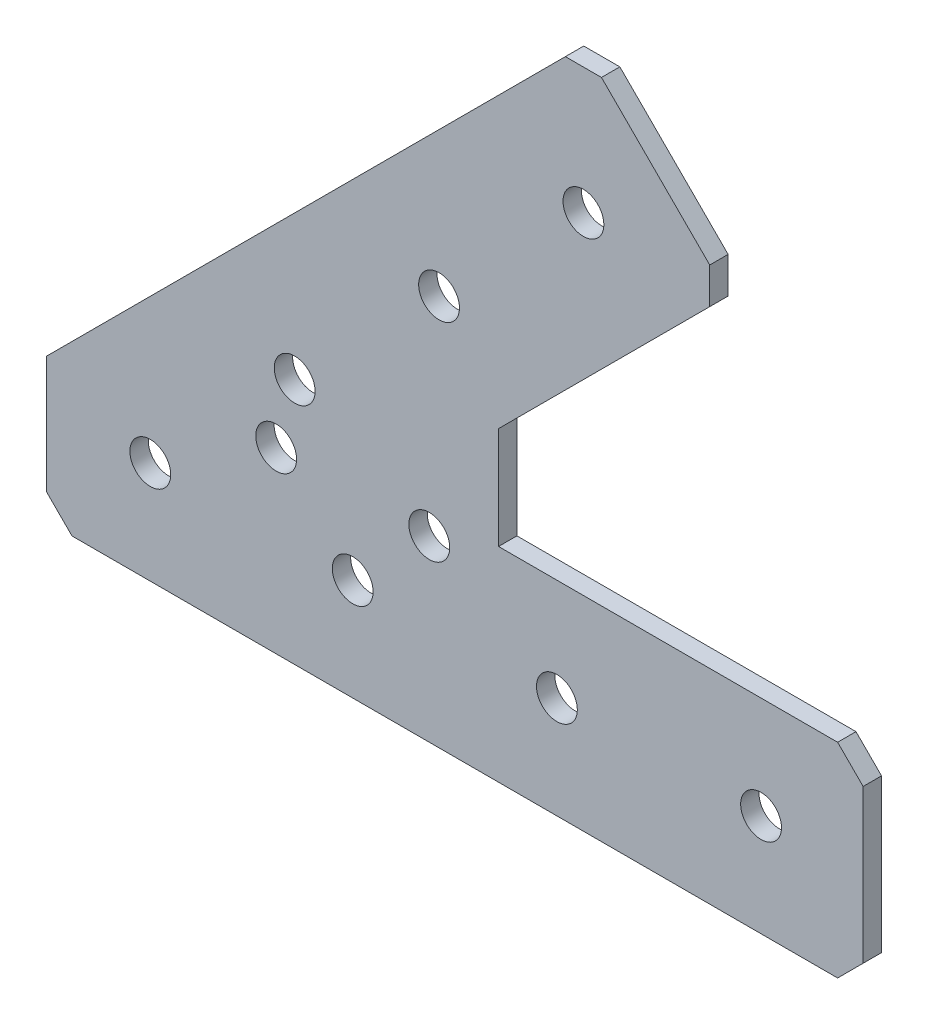
ISO-10303-21;
HEADER;
FILE_DESCRIPTION(('STEP AP214'),'2;1');
FILE_NAME('part.step','',(''),(''),'','','');
FILE_SCHEMA(('AUTOMOTIVE_DESIGN { 1 0 10303 214 1 1 1 1 }'));
ENDSEC;
DATA;
#1=APPLICATION_CONTEXT('core data for automotive mechanical design processes');
#2=APPLICATION_PROTOCOL_DEFINITION('international standard','automotive_design',2000,#1);
#3=PRODUCT_CONTEXT('',#1,'mechanical');
#4=PRODUCT('Part','Part','',(#3));
#5=PRODUCT_RELATED_PRODUCT_CATEGORY('part','',(#4));
#6=PRODUCT_DEFINITION_FORMATION('','',#4);
#7=PRODUCT_DEFINITION_CONTEXT('part definition',#1,'design');
#8=PRODUCT_DEFINITION('design','',#6,#7);
#9=PRODUCT_DEFINITION_SHAPE('','',#8);
#10=(LENGTH_UNIT() NAMED_UNIT(*) SI_UNIT(.MILLI.,.METRE.));
#11=(NAMED_UNIT(*) PLANE_ANGLE_UNIT() SI_UNIT($,.RADIAN.));
#12=(NAMED_UNIT(*) SI_UNIT($,.STERADIAN.) SOLID_ANGLE_UNIT());
#13=UNCERTAINTY_MEASURE_WITH_UNIT(LENGTH_MEASURE(1.E-05),#10,'distance_accuracy_value','');
#14=(GEOMETRIC_REPRESENTATION_CONTEXT(3) GLOBAL_UNCERTAINTY_ASSIGNED_CONTEXT((#13)) GLOBAL_UNIT_ASSIGNED_CONTEXT((#10,
#11,#12)) REPRESENTATION_CONTEXT('',''));
#15=CARTESIAN_POINT('',(0.,0.,0.));
#16=DIRECTION('',(0.,0.,1.));
#17=DIRECTION('',(1.,0.,0.));
#18=AXIS2_PLACEMENT_3D('',#15,#16,#17);
#19=CARTESIAN_POINT('',(0.,0.,-2.286));
#20=DIRECTION('',(0.,0.,1.));
#21=DIRECTION('',(1.,0.,0.));
#22=AXIS2_PLACEMENT_3D('',#19,#20,#21);
#23=PLANE('',#22);
#24=DIRECTION('',(0.,1.,0.));
#25=VECTOR('',#24,1.);
#26=CARTESIAN_POINT('',(27.9053360497169,51.6743115654397,-2.286));
#27=LINE('',#26,#25);
#28=CARTESIAN_POINT('',(27.9053360497169,51.6743115654397,-2.286));
#29=VERTEX_POINT('',#28);
#30=CARTESIAN_POINT('',(27.9053360497169,56.1644396259744,-2.286));
#31=VERTEX_POINT('',#30);
#32=EDGE_CURVE('E531',#29,#31,#27,.T.);
#33=ORIENTED_EDGE('',*,*,#32,.F.);
#34=DIRECTION('',(0.707106781186551,0.707106781186544,0.));
#35=VECTOR('',#34,1.);
#36=CARTESIAN_POINT('',(1.63102448427699,25.4000000000001,-2.286));
#37=LINE('',#36,#35);
#38=CARTESIAN_POINT('',(1.63102448427699,25.4000000000001,-2.286));
#39=VERTEX_POINT('',#38);
#40=EDGE_CURVE('E528',#39,#29,#37,.T.);
#41=ORIENTED_EDGE('',*,*,#40,.F.);
#42=DIRECTION('',(0.,1.,0.));
#43=VECTOR('',#42,1.);
#44=CARTESIAN_POINT('',(1.63102448427696,12.7,-2.286));
#45=LINE('',#44,#43);
#46=CARTESIAN_POINT('',(1.63102448427696,12.7,-2.286));
#47=VERTEX_POINT('',#46);
#48=EDGE_CURVE('E523',#47,#39,#45,.T.);
#49=ORIENTED_EDGE('',*,*,#48,.F.);
#50=DIRECTION('',(1.,0.,0.));
#51=VECTOR('',#50,1.);
#52=CARTESIAN_POINT('',(43.815,12.7,-2.286));
#53=LINE('',#52,#51);
#54=CARTESIAN_POINT('',(43.815,12.7,-2.286));
#55=VERTEX_POINT('',#54);
#56=EDGE_CURVE('E518',#55,#47,#53,.F.);
#57=ORIENTED_EDGE('',*,*,#56,.F.);
#58=DIRECTION('',(-0.707106781186549,0.707106781186546,0.));
#59=VECTOR('',#58,1.);
#60=CARTESIAN_POINT('',(46.99,9.52499999999999,-2.286));
#61=LINE('',#60,#59);
#62=CARTESIAN_POINT('',(46.99,9.52499999999999,-2.286));
#63=VERTEX_POINT('',#62);
#64=EDGE_CURVE('E513',#63,#55,#61,.T.);
#65=ORIENTED_EDGE('',*,*,#64,.F.);
#66=DIRECTION('',(0.,1.,0.));
#67=VECTOR('',#66,1.);
#68=CARTESIAN_POINT('',(46.99,-9.52499999999998,-2.286));
#69=LINE('',#68,#67);
#70=CARTESIAN_POINT('',(46.99,-9.52499999999998,-2.286));
#71=VERTEX_POINT('',#70);
#72=EDGE_CURVE('E508',#71,#63,#69,.T.);
#73=ORIENTED_EDGE('',*,*,#72,.F.);
#74=DIRECTION('',(0.707106781186545,0.70710678118655,0.));
#75=VECTOR('',#74,1.);
#76=CARTESIAN_POINT('',(43.815,-12.7,-2.286));
#77=LINE('',#76,#75);
#78=CARTESIAN_POINT('',(43.815,-12.7,-2.286));
#79=VERTEX_POINT('',#78);
#80=EDGE_CURVE('E503',#79,#71,#77,.T.);
#81=ORIENTED_EDGE('',*,*,#80,.F.);
#82=DIRECTION('',(1.,0.,0.));
#83=VECTOR('',#82,1.);
#84=CARTESIAN_POINT('',(-51.4350000000003,-12.7,-2.286));
#85=LINE('',#84,#83);
#86=CARTESIAN_POINT('',(-51.4350000000003,-12.7,-2.286));
#87=VERTEX_POINT('',#86);
#88=EDGE_CURVE('E498',#87,#79,#85,.T.);
#89=ORIENTED_EDGE('',*,*,#88,.F.);
#90=DIRECTION('',(0.707106781186546,-0.707106781186549,0.));
#91=VECTOR('',#90,1.);
#92=CARTESIAN_POINT('',(-54.6100000000003,-9.525,-2.286));
#93=LINE('',#92,#91);
#94=CARTESIAN_POINT('',(-54.6100000000003,-9.525,-2.286));
#95=VERTEX_POINT('',#94);
#96=EDGE_CURVE('E484',#95,#87,#93,.T.);
#97=ORIENTED_EDGE('',*,*,#96,.F.);
#98=DIRECTION('',(0.,-1.,0.));
#99=VECTOR('',#98,1.);
#100=CARTESIAN_POINT('',(-54.6100000000003,5.0799999999998,-2.286));
#101=LINE('',#100,#99);
#102=CARTESIAN_POINT('',(-54.6100000000003,5.07999999999979,-2.286));
#103=VERTEX_POINT('',#102);
#104=EDGE_CURVE('E482',#103,#95,#101,.T.);
#105=ORIENTED_EDGE('',*,*,#104,.F.);
#106=DIRECTION('',(-0.707106781186551,-0.707106781186544,0.));
#107=VECTOR('',#106,1.);
#108=CARTESIAN_POINT('',(9.94482380757869,69.6348238075781,-2.286));
#109=LINE('',#108,#107);
#110=CARTESIAN_POINT('',(9.94482380757869,69.6348238075781,-2.286));
#111=VERTEX_POINT('',#110);
#112=EDGE_CURVE('E128',#111,#103,#109,.T.);
#113=ORIENTED_EDGE('',*,*,#112,.F.);
#114=DIRECTION('',(-1.,0.,0.));
#115=VECTOR('',#114,1.);
#116=CARTESIAN_POINT('',(14.4349518681133,69.6348238075781,-2.286));
#117=LINE('',#116,#115);
#118=CARTESIAN_POINT('',(14.4349518681133,69.6348238075781,-2.286));
#119=VERTEX_POINT('',#118);
#120=EDGE_CURVE('E110',#119,#111,#117,.T.);
#121=ORIENTED_EDGE('',*,*,#120,.F.);
#122=DIRECTION('',(-0.707106781186544,0.707106781186551,0.));
#123=VECTOR('',#122,1.);
#124=CARTESIAN_POINT('',(27.9053360497169,56.1644396259743,-2.286));
#125=LINE('',#124,#123);
#126=EDGE_CURVE('E115',#31,#119,#125,.T.);
#127=ORIENTED_EDGE('',*,*,#126,.F.);
#128=EDGE_LOOP('',(#33,#41,#49,#57,#65,#73,#81,#89,#97,#105,#113,#121,#127));
#129=FACE_BOUND('',#128,.T.);
#130=CARTESIAN_POINT('',(12.1898878378457,53.9193755957072,-2.286));
#131=DIRECTION('',(0.,0.,1.));
#132=DIRECTION('',(1.,0.,0.));
#133=AXIS2_PLACEMENT_3D('',#130,#131,#132);
#134=CIRCLE('',#133,2.54);
#135=CARTESIAN_POINT('',(14.7298878378457,53.9193755957072,-2.286));
#136=VERTEX_POINT('',#135);
#137=EDGE_CURVE('E124',#136,#136,#134,.T.);
#138=ORIENTED_EDGE('',*,*,#137,.T.);
#139=EDGE_LOOP('',(#138));
#140=FACE_BOUND('',#139,.T.);
#141=CARTESIAN_POINT('',(-5.77062440429268,35.958863353569,-2.286));
#142=DIRECTION('',(0.,0.,1.));
#143=DIRECTION('',(1.,0.,0.));
#144=AXIS2_PLACEMENT_3D('',#141,#142,#143);
#145=CIRCLE('',#144,2.54);
#146=CARTESIAN_POINT('',(-3.23062440429268,35.958863353569,-2.286));
#147=VERTEX_POINT('',#146);
#148=EDGE_CURVE('E169',#147,#147,#145,.T.);
#149=ORIENTED_EDGE('',*,*,#148,.T.);
#150=EDGE_LOOP('',(#149));
#151=FACE_BOUND('',#150,.T.);
#152=CARTESIAN_POINT('',(-23.7311366464311,17.9983511114308,-2.286));
#153=DIRECTION('',(0.,0.,1.));
#154=DIRECTION('',(1.,0.,0.));
#155=AXIS2_PLACEMENT_3D('',#152,#153,#154);
#156=CIRCLE('',#155,2.54);
#157=CARTESIAN_POINT('',(-21.1911366464311,17.9983511114308,-2.286));
#158=VERTEX_POINT('',#157);
#159=EDGE_CURVE('E172',#158,#158,#156,.T.);
#160=ORIENTED_EDGE('',*,*,#159,.T.);
#161=EDGE_LOOP('',(#160));
#162=FACE_BOUND('',#161,.T.);
#163=CARTESIAN_POINT('',(-41.6916488885695,0.0378388692925738,-2.286));
#164=DIRECTION('',(0.,0.,1.));
#165=DIRECTION('',(1.,0.,0.));
#166=AXIS2_PLACEMENT_3D('',#163,#164,#165);
#167=CIRCLE('',#166,2.54);
#168=CARTESIAN_POINT('',(-39.1516488885695,0.0378388692925738,-2.286));
#169=VERTEX_POINT('',#168);
#170=EDGE_CURVE('E175',#169,#169,#167,.T.);
#171=ORIENTED_EDGE('',*,*,#170,.T.);
#172=EDGE_LOOP('',(#171));
#173=FACE_BOUND('',#172,.T.);
#174=CARTESIAN_POINT('',(34.29,0.,-2.286));
#175=DIRECTION('',(0.,0.,1.));
#176=DIRECTION('',(1.,0.,0.));
#177=AXIS2_PLACEMENT_3D('',#174,#175,#176);
#178=CIRCLE('',#177,2.54);
#179=CARTESIAN_POINT('',(36.83,0.,-2.286));
#180=VERTEX_POINT('',#179);
#181=EDGE_CURVE('E178',#180,#180,#178,.T.);
#182=ORIENTED_EDGE('',*,*,#181,.T.);
#183=EDGE_LOOP('',(#182));
#184=FACE_BOUND('',#183,.T.);
#185=CARTESIAN_POINT('',(8.89,0.,-2.286));
#186=DIRECTION('',(0.,0.,1.));
#187=DIRECTION('',(1.,0.,0.));
#188=AXIS2_PLACEMENT_3D('',#185,#186,#187);
#189=CIRCLE('',#188,2.54);
#190=CARTESIAN_POINT('',(11.43,0.,-2.286));
#191=VERTEX_POINT('',#190);
#192=EDGE_CURVE('E181',#191,#191,#189,.T.);
#193=ORIENTED_EDGE('',*,*,#192,.T.);
#194=EDGE_LOOP('',(#193));
#195=FACE_BOUND('',#194,.T.);
#196=CARTESIAN_POINT('',(-16.51,0.,-2.286));
#197=DIRECTION('',(0.,0.,1.));
#198=DIRECTION('',(1.,0.,0.));
#199=AXIS2_PLACEMENT_3D('',#196,#197,#198);
#200=CIRCLE('',#199,2.54);
#201=CARTESIAN_POINT('',(-13.97,0.,-2.286));
#202=VERTEX_POINT('',#201);
#203=EDGE_CURVE('E184',#202,#202,#200,.T.);
#204=ORIENTED_EDGE('',*,*,#203,.T.);
#205=EDGE_LOOP('',(#204));
#206=FACE_BOUND('',#205,.T.);
#207=CARTESIAN_POINT('',(-6.98499999999999,9.52499999999999,-2.286));
#208=DIRECTION('',(0.,0.,1.));
#209=DIRECTION('',(1.,0.,0.));
#210=AXIS2_PLACEMENT_3D('',#207,#208,#209);
#211=CIRCLE('',#210,2.54);
#212=CARTESIAN_POINT('',(-4.44499999999999,9.52499999999999,-2.286));
#213=VERTEX_POINT('',#212);
#214=EDGE_CURVE('E186',#213,#213,#211,.T.);
#215=ORIENTED_EDGE('',*,*,#214,.T.);
#216=EDGE_LOOP('',(#215));
#217=FACE_BOUND('',#216,.T.);
#218=CARTESIAN_POINT('',(-26.035,9.52499999999999,-2.286));
#219=DIRECTION('',(0.,0.,1.));
#220=DIRECTION('',(1.,0.,0.));
#221=AXIS2_PLACEMENT_3D('',#218,#219,#220);
#222=CIRCLE('',#221,2.54);
#223=CARTESIAN_POINT('',(-23.495,9.52499999999999,-2.286));
#224=VERTEX_POINT('',#223);
#225=EDGE_CURVE('E21',#224,#224,#222,.T.);
#226=ORIENTED_EDGE('',*,*,#225,.T.);
#227=EDGE_LOOP('',(#226));
#228=FACE_BOUND('',#227,.T.);
#229=ADVANCED_FACE('F18',(#129,#140,#151,#162,#173,#184,#195,#206,#217,#228),#23,.F.);
#230=CARTESIAN_POINT('',(-26.035,9.52499999999999,-2.286));
#231=DIRECTION('',(0.,0.,1.));
#232=DIRECTION('',(1.,0.,0.));
#233=AXIS2_PLACEMENT_3D('',#230,#231,#232);
#234=CYLINDRICAL_SURFACE('',#233,2.54);
#235=CARTESIAN_POINT('',(-26.035,9.52499999999999,0.));
#236=DIRECTION('',(0.,0.,1.));
#237=DIRECTION('',(1.,0.,0.));
#238=AXIS2_PLACEMENT_3D('',#235,#236,#237);
#239=CIRCLE('',#238,2.54);
#240=CARTESIAN_POINT('',(-23.495,9.52499999999999,0.));
#241=VERTEX_POINT('',#240);
#242=EDGE_CURVE('E164',#241,#241,#239,.F.);
#243=ORIENTED_EDGE('',*,*,#242,.F.);
#244=EDGE_LOOP('',(#243));
#245=FACE_BOUND('',#244,.T.);
#246=ORIENTED_EDGE('',*,*,#225,.F.);
#247=EDGE_LOOP('',(#246));
#248=FACE_BOUND('',#247,.T.);
#249=ADVANCED_FACE('F194',(#245,#248),#234,.F.);
#250=CARTESIAN_POINT('',(-6.98499999999999,9.52499999999999,-2.286));
#251=DIRECTION('',(0.,0.,1.));
#252=DIRECTION('',(1.,0.,0.));
#253=AXIS2_PLACEMENT_3D('',#250,#251,#252);
#254=CYLINDRICAL_SURFACE('',#253,2.54);
#255=CARTESIAN_POINT('',(-6.98499999999999,9.52499999999999,0.));
#256=DIRECTION('',(0.,0.,1.));
#257=DIRECTION('',(1.,0.,0.));
#258=AXIS2_PLACEMENT_3D('',#255,#256,#257);
#259=CIRCLE('',#258,2.54);
#260=CARTESIAN_POINT('',(-4.44499999999999,9.52499999999999,0.));
#261=VERTEX_POINT('',#260);
#262=EDGE_CURVE('E161',#261,#261,#259,.F.);
#263=ORIENTED_EDGE('',*,*,#262,.F.);
#264=EDGE_LOOP('',(#263));
#265=FACE_BOUND('',#264,.T.);
#266=ORIENTED_EDGE('',*,*,#214,.F.);
#267=EDGE_LOOP('',(#266));
#268=FACE_BOUND('',#267,.T.);
#269=ADVANCED_FACE('F196',(#265,#268),#254,.F.);
#270=CARTESIAN_POINT('',(-16.51,0.,-2.286));
#271=DIRECTION('',(0.,0.,1.));
#272=DIRECTION('',(1.,0.,0.));
#273=AXIS2_PLACEMENT_3D('',#270,#271,#272);
#274=CYLINDRICAL_SURFACE('',#273,2.54);
#275=CARTESIAN_POINT('',(-16.51,0.,0.));
#276=DIRECTION('',(0.,0.,1.));
#277=DIRECTION('',(1.,0.,0.));
#278=AXIS2_PLACEMENT_3D('',#275,#276,#277);
#279=CIRCLE('',#278,2.54);
#280=CARTESIAN_POINT('',(-13.97,0.,0.));
#281=VERTEX_POINT('',#280);
#282=EDGE_CURVE('E158',#281,#281,#279,.F.);
#283=ORIENTED_EDGE('',*,*,#282,.F.);
#284=EDGE_LOOP('',(#283));
#285=FACE_BOUND('',#284,.T.);
#286=ORIENTED_EDGE('',*,*,#203,.F.);
#287=EDGE_LOOP('',(#286));
#288=FACE_BOUND('',#287,.T.);
#289=ADVANCED_FACE('F203',(#285,#288),#274,.F.);
#290=CARTESIAN_POINT('',(8.89,0.,-2.286));
#291=DIRECTION('',(0.,0.,1.));
#292=DIRECTION('',(1.,0.,0.));
#293=AXIS2_PLACEMENT_3D('',#290,#291,#292);
#294=CYLINDRICAL_SURFACE('',#293,2.54);
#295=CARTESIAN_POINT('',(8.89,0.,0.));
#296=DIRECTION('',(0.,0.,1.));
#297=DIRECTION('',(1.,0.,0.));
#298=AXIS2_PLACEMENT_3D('',#295,#296,#297);
#299=CIRCLE('',#298,2.54);
#300=CARTESIAN_POINT('',(11.43,0.,0.));
#301=VERTEX_POINT('',#300);
#302=EDGE_CURVE('E155',#301,#301,#299,.F.);
#303=ORIENTED_EDGE('',*,*,#302,.F.);
#304=EDGE_LOOP('',(#303));
#305=FACE_BOUND('',#304,.T.);
#306=ORIENTED_EDGE('',*,*,#192,.F.);
#307=EDGE_LOOP('',(#306));
#308=FACE_BOUND('',#307,.T.);
#309=ADVANCED_FACE('F282',(#305,#308),#294,.F.);
#310=CARTESIAN_POINT('',(34.29,0.,-2.286));
#311=DIRECTION('',(0.,0.,1.));
#312=DIRECTION('',(1.,0.,0.));
#313=AXIS2_PLACEMENT_3D('',#310,#311,#312);
#314=CYLINDRICAL_SURFACE('',#313,2.54);
#315=CARTESIAN_POINT('',(34.29,0.,0.));
#316=DIRECTION('',(0.,0.,1.));
#317=DIRECTION('',(1.,0.,0.));
#318=AXIS2_PLACEMENT_3D('',#315,#316,#317);
#319=CIRCLE('',#318,2.54);
#320=CARTESIAN_POINT('',(36.83,0.,0.));
#321=VERTEX_POINT('',#320);
#322=EDGE_CURVE('E152',#321,#321,#319,.F.);
#323=ORIENTED_EDGE('',*,*,#322,.F.);
#324=EDGE_LOOP('',(#323));
#325=FACE_BOUND('',#324,.T.);
#326=ORIENTED_EDGE('',*,*,#181,.F.);
#327=EDGE_LOOP('',(#326));
#328=FACE_BOUND('',#327,.T.);
#329=ADVANCED_FACE('F278',(#325,#328),#314,.F.);
#330=CARTESIAN_POINT('',(-41.6916488885695,0.0378388692925738,-2.286));
#331=DIRECTION('',(0.,0.,1.));
#332=DIRECTION('',(1.,0.,0.));
#333=AXIS2_PLACEMENT_3D('',#330,#331,#332);
#334=CYLINDRICAL_SURFACE('',#333,2.54);
#335=CARTESIAN_POINT('',(-41.6916488885695,0.0378388692925738,0.));
#336=DIRECTION('',(0.,0.,1.));
#337=DIRECTION('',(1.,0.,0.));
#338=AXIS2_PLACEMENT_3D('',#335,#336,#337);
#339=CIRCLE('',#338,2.54);
#340=CARTESIAN_POINT('',(-39.1516488885695,0.0378388692925738,0.));
#341=VERTEX_POINT('',#340);
#342=EDGE_CURVE('E149',#341,#341,#339,.F.);
#343=ORIENTED_EDGE('',*,*,#342,.F.);
#344=EDGE_LOOP('',(#343));
#345=FACE_BOUND('',#344,.T.);
#346=ORIENTED_EDGE('',*,*,#170,.F.);
#347=EDGE_LOOP('',(#346));
#348=FACE_BOUND('',#347,.T.);
#349=ADVANCED_FACE('F274',(#345,#348),#334,.F.);
#350=CARTESIAN_POINT('',(-23.7311366464311,17.9983511114308,-2.286));
#351=DIRECTION('',(0.,0.,1.));
#352=DIRECTION('',(1.,0.,0.));
#353=AXIS2_PLACEMENT_3D('',#350,#351,#352);
#354=CYLINDRICAL_SURFACE('',#353,2.54);
#355=CARTESIAN_POINT('',(-23.7311366464311,17.9983511114308,0.));
#356=DIRECTION('',(0.,0.,1.));
#357=DIRECTION('',(1.,0.,0.));
#358=AXIS2_PLACEMENT_3D('',#355,#356,#357);
#359=CIRCLE('',#358,2.54);
#360=CARTESIAN_POINT('',(-21.1911366464311,17.9983511114308,0.));
#361=VERTEX_POINT('',#360);
#362=EDGE_CURVE('E146',#361,#361,#359,.F.);
#363=ORIENTED_EDGE('',*,*,#362,.F.);
#364=EDGE_LOOP('',(#363));
#365=FACE_BOUND('',#364,.T.);
#366=ORIENTED_EDGE('',*,*,#159,.F.);
#367=EDGE_LOOP('',(#366));
#368=FACE_BOUND('',#367,.T.);
#369=ADVANCED_FACE('F270',(#365,#368),#354,.F.);
#370=CARTESIAN_POINT('',(-5.77062440429268,35.958863353569,-2.286));
#371=DIRECTION('',(0.,0.,1.));
#372=DIRECTION('',(1.,0.,0.));
#373=AXIS2_PLACEMENT_3D('',#370,#371,#372);
#374=CYLINDRICAL_SURFACE('',#373,2.54);
#375=CARTESIAN_POINT('',(-5.77062440429268,35.958863353569,0.));
#376=DIRECTION('',(0.,0.,1.));
#377=DIRECTION('',(1.,0.,0.));
#378=AXIS2_PLACEMENT_3D('',#375,#376,#377);
#379=CIRCLE('',#378,2.54);
#380=CARTESIAN_POINT('',(-3.23062440429268,35.958863353569,0.));
#381=VERTEX_POINT('',#380);
#382=EDGE_CURVE('E143',#381,#381,#379,.F.);
#383=ORIENTED_EDGE('',*,*,#382,.F.);
#384=EDGE_LOOP('',(#383));
#385=FACE_BOUND('',#384,.T.);
#386=ORIENTED_EDGE('',*,*,#148,.F.);
#387=EDGE_LOOP('',(#386));
#388=FACE_BOUND('',#387,.T.);
#389=ADVANCED_FACE('F266',(#385,#388),#374,.F.);
#390=CARTESIAN_POINT('',(12.1898878378457,53.9193755957072,-2.286));
#391=DIRECTION('',(0.,0.,1.));
#392=DIRECTION('',(1.,0.,0.));
#393=AXIS2_PLACEMENT_3D('',#390,#391,#392);
#394=CYLINDRICAL_SURFACE('',#393,2.54);
#395=CARTESIAN_POINT('',(12.1898878378457,53.9193755957072,0.));
#396=DIRECTION('',(0.,0.,1.));
#397=DIRECTION('',(1.,0.,0.));
#398=AXIS2_PLACEMENT_3D('',#395,#396,#397);
#399=CIRCLE('',#398,2.54);
#400=CARTESIAN_POINT('',(14.7298878378457,53.9193755957072,0.));
#401=VERTEX_POINT('',#400);
#402=EDGE_CURVE('E139',#401,#401,#399,.F.);
#403=ORIENTED_EDGE('',*,*,#402,.F.);
#404=EDGE_LOOP('',(#403));
#405=FACE_BOUND('',#404,.T.);
#406=ORIENTED_EDGE('',*,*,#137,.F.);
#407=EDGE_LOOP('',(#406));
#408=FACE_BOUND('',#407,.T.);
#409=ADVANCED_FACE('F263',(#405,#408),#394,.F.);
#410=CARTESIAN_POINT('',(27.9053360497169,56.1644396259743,-2.286));
#411=DIRECTION('',(0.707106781186551,0.707106781186544,0.));
#412=DIRECTION('',(-0.707106781186544,0.707106781186551,0.));
#413=AXIS2_PLACEMENT_3D('',#410,#411,#412);
#414=PLANE('',#413);
#415=ORIENTED_EDGE('',*,*,#126,.T.);
#416=DIRECTION('',(0.,0.,1.));
#417=VECTOR('',#416,1.);
#418=CARTESIAN_POINT('',(14.4349518681133,69.6348238075781,-2.286));
#419=LINE('',#418,#417);
#420=CARTESIAN_POINT('',(14.4349518681133,69.6348238075781,0.));
#421=VERTEX_POINT('',#420);
#422=EDGE_CURVE('E117',#421,#119,#419,.F.);
#423=ORIENTED_EDGE('',*,*,#422,.F.);
#424=DIRECTION('',(-0.707106781186544,0.707106781186551,0.));
#425=VECTOR('',#424,1.);
#426=CARTESIAN_POINT('',(27.9053360497169,56.1644396259743,0.));
#427=LINE('',#426,#425);
#428=CARTESIAN_POINT('',(27.9053360497169,56.1644396259744,0.));
#429=VERTEX_POINT('',#428);
#430=EDGE_CURVE('E142',#429,#421,#427,.T.);
#431=ORIENTED_EDGE('',*,*,#430,.F.);
#432=DIRECTION('',(0.,0.,1.));
#433=VECTOR('',#432,1.);
#434=CARTESIAN_POINT('',(27.9053360497169,56.1644396259743,-2.286));
#435=LINE('',#434,#433);
#436=EDGE_CURVE('E120',#31,#429,#435,.T.);
#437=ORIENTED_EDGE('',*,*,#436,.F.);
#438=EDGE_LOOP('',(#415,#423,#431,#437));
#439=FACE_BOUND('',#438,.T.);
#440=ADVANCED_FACE('F116',(#439),#414,.T.);
#441=CARTESIAN_POINT('',(14.4349518681133,69.6348238075781,-2.286));
#442=DIRECTION('',(0.,1.,0.));
#443=DIRECTION('',(-1.,0.,0.));
#444=AXIS2_PLACEMENT_3D('',#441,#442,#443);
#445=PLANE('',#444);
#446=ORIENTED_EDGE('',*,*,#120,.T.);
#447=DIRECTION('',(0.,0.,1.));
#448=VECTOR('',#447,1.);
#449=CARTESIAN_POINT('',(9.94482380757869,69.6348238075781,-2.286));
#450=LINE('',#449,#448);
#451=CARTESIAN_POINT('',(9.94482380757869,69.6348238075781,0.));
#452=VERTEX_POINT('',#451);
#453=EDGE_CURVE('E130',#452,#111,#450,.F.);
#454=ORIENTED_EDGE('',*,*,#453,.F.);
#455=DIRECTION('',(1.,0.,0.));
#456=VECTOR('',#455,1.);
#457=CARTESIAN_POINT('',(0.,69.6348238075781,0.));
#458=LINE('',#457,#456);
#459=EDGE_CURVE('E134',#421,#452,#458,.F.);
#460=ORIENTED_EDGE('',*,*,#459,.F.);
#461=ORIENTED_EDGE('',*,*,#422,.T.);
#462=EDGE_LOOP('',(#446,#454,#460,#461));
#463=FACE_BOUND('',#462,.T.);
#464=ADVANCED_FACE('F132',(#463),#445,.T.);
#465=CARTESIAN_POINT('',(9.94482380757869,69.6348238075781,-2.286));
#466=DIRECTION('',(-0.707106781186544,0.707106781186551,0.));
#467=DIRECTION('',(-0.707106781186551,-0.707106781186544,0.));
#468=AXIS2_PLACEMENT_3D('',#465,#466,#467);
#469=PLANE('',#468);
#470=ORIENTED_EDGE('',*,*,#112,.T.);
#471=DIRECTION('',(0.,0.,1.));
#472=VECTOR('',#471,1.);
#473=CARTESIAN_POINT('',(-54.6100000000003,5.0799999999998,-2.286));
#474=LINE('',#473,#472);
#475=CARTESIAN_POINT('',(-54.6100000000003,5.07999999999979,0.));
#476=VERTEX_POINT('',#475);
#477=EDGE_CURVE('E478',#476,#103,#474,.F.);
#478=ORIENTED_EDGE('',*,*,#477,.F.);
#479=DIRECTION('',(-0.707106781186551,-0.707106781186544,0.));
#480=VECTOR('',#479,1.);
#481=CARTESIAN_POINT('',(9.94482380757869,69.6348238075781,0.));
#482=LINE('',#481,#480);
#483=EDGE_CURVE('E536',#452,#476,#482,.T.);
#484=ORIENTED_EDGE('',*,*,#483,.F.);
#485=ORIENTED_EDGE('',*,*,#453,.T.);
#486=EDGE_LOOP('',(#470,#478,#484,#485));
#487=FACE_BOUND('',#486,.T.);
#488=ADVANCED_FACE('F254',(#487),#469,.T.);
#489=CARTESIAN_POINT('',(-54.6100000000003,5.0799999999998,-2.286));
#490=DIRECTION('',(-1.,0.,0.));
#491=DIRECTION('',(0.,-1.,0.));
#492=AXIS2_PLACEMENT_3D('',#489,#490,#491);
#493=PLANE('',#492);
#494=ORIENTED_EDGE('',*,*,#104,.T.);
#495=DIRECTION('',(0.,0.,1.));
#496=VECTOR('',#495,1.);
#497=CARTESIAN_POINT('',(-54.6100000000003,-9.525,-2.286));
#498=LINE('',#497,#496);
#499=CARTESIAN_POINT('',(-54.6100000000003,-9.525,0.));
#500=VERTEX_POINT('',#499);
#501=EDGE_CURVE('E486',#500,#95,#498,.F.);
#502=ORIENTED_EDGE('',*,*,#501,.F.);
#503=DIRECTION('',(0.,1.,0.));
#504=VECTOR('',#503,1.);
#505=CARTESIAN_POINT('',(-54.6100000000003,0.,0.));
#506=LINE('',#505,#504);
#507=EDGE_CURVE('E489',#476,#500,#506,.F.);
#508=ORIENTED_EDGE('',*,*,#507,.F.);
#509=ORIENTED_EDGE('',*,*,#477,.T.);
#510=EDGE_LOOP('',(#494,#502,#508,#509));
#511=FACE_BOUND('',#510,.T.);
#512=ADVANCED_FACE('F250',(#511),#493,.T.);
#513=CARTESIAN_POINT('',(-54.6100000000003,-9.525,-2.286));
#514=DIRECTION('',(-0.707106781186549,-0.707106781186546,0.));
#515=DIRECTION('',(0.707106781186546,-0.707106781186549,0.));
#516=AXIS2_PLACEMENT_3D('',#513,#514,#515);
#517=PLANE('',#516);
#518=ORIENTED_EDGE('',*,*,#96,.T.);
#519=DIRECTION('',(0.,0.,1.));
#520=VECTOR('',#519,1.);
#521=CARTESIAN_POINT('',(-51.4350000000003,-12.7,-2.286));
#522=LINE('',#521,#520);
#523=CARTESIAN_POINT('',(-51.4350000000003,-12.7,0.));
#524=VERTEX_POINT('',#523);
#525=EDGE_CURVE('E495',#524,#87,#522,.F.);
#526=ORIENTED_EDGE('',*,*,#525,.F.);
#527=DIRECTION('',(0.707106781186548,-0.707106781186547,0.));
#528=VECTOR('',#527,1.);
#529=CARTESIAN_POINT('',(-54.6100000000003,-9.525,0.));
#530=LINE('',#529,#528);
#531=EDGE_CURVE('E539',#500,#524,#530,.T.);
#532=ORIENTED_EDGE('',*,*,#531,.F.);
#533=ORIENTED_EDGE('',*,*,#501,.T.);
#534=EDGE_LOOP('',(#518,#526,#532,#533));
#535=FACE_BOUND('',#534,.T.);
#536=ADVANCED_FACE('F246',(#535),#517,.T.);
#537=CARTESIAN_POINT('',(-51.4350000000003,-12.7,-2.286));
#538=DIRECTION('',(0.,-1.,0.));
#539=DIRECTION('',(1.,0.,0.));
#540=AXIS2_PLACEMENT_3D('',#537,#538,#539);
#541=PLANE('',#540);
#542=ORIENTED_EDGE('',*,*,#88,.T.);
#543=DIRECTION('',(0.,0.,1.));
#544=VECTOR('',#543,1.);
#545=CARTESIAN_POINT('',(43.815,-12.7,-2.286));
#546=LINE('',#545,#544);
#547=CARTESIAN_POINT('',(43.815,-12.7,0.));
#548=VERTEX_POINT('',#547);
#549=EDGE_CURVE('E500',#548,#79,#546,.F.);
#550=ORIENTED_EDGE('',*,*,#549,.F.);
#551=DIRECTION('',(1.,0.,0.));
#552=VECTOR('',#551,1.);
#553=CARTESIAN_POINT('',(0.,-12.7,0.));
#554=LINE('',#553,#552);
#555=EDGE_CURVE('E542',#524,#548,#554,.T.);
#556=ORIENTED_EDGE('',*,*,#555,.F.);
#557=ORIENTED_EDGE('',*,*,#525,.T.);
#558=EDGE_LOOP('',(#542,#550,#556,#557));
#559=FACE_BOUND('',#558,.T.);
#560=ADVANCED_FACE('F242',(#559),#541,.T.);
#561=CARTESIAN_POINT('',(43.815,-12.7,-2.286));
#562=DIRECTION('',(0.70710678118655,-0.707106781186545,0.));
#563=DIRECTION('',(0.707106781186545,0.70710678118655,0.));
#564=AXIS2_PLACEMENT_3D('',#561,#562,#563);
#565=PLANE('',#564);
#566=ORIENTED_EDGE('',*,*,#80,.T.);
#567=DIRECTION('',(0.,0.,-1.));
#568=VECTOR('',#567,1.);
#569=CARTESIAN_POINT('',(46.99,-9.52499999999998,-2.286));
#570=LINE('',#569,#568);
#571=CARTESIAN_POINT('',(46.99,-9.52499999999998,0.));
#572=VERTEX_POINT('',#571);
#573=EDGE_CURVE('E505',#572,#71,#570,.T.);
#574=ORIENTED_EDGE('',*,*,#573,.F.);
#575=DIRECTION('',(0.707106781186545,0.70710678118655,0.));
#576=VECTOR('',#575,1.);
#577=CARTESIAN_POINT('',(43.815,-12.7,0.));
#578=LINE('',#577,#576);
#579=EDGE_CURVE('E545',#548,#572,#578,.T.);
#580=ORIENTED_EDGE('',*,*,#579,.F.);
#581=ORIENTED_EDGE('',*,*,#549,.T.);
#582=EDGE_LOOP('',(#566,#574,#580,#581));
#583=FACE_BOUND('',#582,.T.);
#584=ADVANCED_FACE('F238',(#583),#565,.T.);
#585=CARTESIAN_POINT('',(46.99,-9.52499999999998,-2.286));
#586=DIRECTION('',(1.,0.,0.));
#587=DIRECTION('',(0.,0.,-1.));
#588=AXIS2_PLACEMENT_3D('',#585,#586,#587);
#589=PLANE('',#588);
#590=ORIENTED_EDGE('',*,*,#72,.T.);
#591=DIRECTION('',(0.,0.,1.));
#592=VECTOR('',#591,1.);
#593=CARTESIAN_POINT('',(46.99,9.52499999999999,-2.286));
#594=LINE('',#593,#592);
#595=CARTESIAN_POINT('',(46.99,9.52499999999999,0.));
#596=VERTEX_POINT('',#595);
#597=EDGE_CURVE('E510',#596,#63,#594,.F.);
#598=ORIENTED_EDGE('',*,*,#597,.F.);
#599=DIRECTION('',(0.,1.,0.));
#600=VECTOR('',#599,1.);
#601=CARTESIAN_POINT('',(46.99,0.,0.));
#602=LINE('',#601,#600);
#603=EDGE_CURVE('E548',#572,#596,#602,.T.);
#604=ORIENTED_EDGE('',*,*,#603,.F.);
#605=ORIENTED_EDGE('',*,*,#573,.T.);
#606=EDGE_LOOP('',(#590,#598,#604,#605));
#607=FACE_BOUND('',#606,.T.);
#608=ADVANCED_FACE('F234',(#607),#589,.T.);
#609=CARTESIAN_POINT('',(46.99,9.52499999999999,-2.286));
#610=DIRECTION('',(0.707106781186546,0.707106781186549,0.));
#611=DIRECTION('',(-0.707106781186549,0.707106781186546,0.));
#612=AXIS2_PLACEMENT_3D('',#609,#610,#611);
#613=PLANE('',#612);
#614=ORIENTED_EDGE('',*,*,#64,.T.);
#615=DIRECTION('',(0.,0.,1.));
#616=VECTOR('',#615,1.);
#617=CARTESIAN_POINT('',(43.815,12.7,-2.286));
#618=LINE('',#617,#616);
#619=CARTESIAN_POINT('',(43.815,12.7,0.));
#620=VERTEX_POINT('',#619);
#621=EDGE_CURVE('E515',#620,#55,#618,.F.);
#622=ORIENTED_EDGE('',*,*,#621,.F.);
#623=DIRECTION('',(-0.707106781186549,0.707106781186546,0.));
#624=VECTOR('',#623,1.);
#625=CARTESIAN_POINT('',(46.99,9.52499999999999,0.));
#626=LINE('',#625,#624);
#627=EDGE_CURVE('E551',#596,#620,#626,.T.);
#628=ORIENTED_EDGE('',*,*,#627,.F.);
#629=ORIENTED_EDGE('',*,*,#597,.T.);
#630=EDGE_LOOP('',(#614,#622,#628,#629));
#631=FACE_BOUND('',#630,.T.);
#632=ADVANCED_FACE('F230',(#631),#613,.T.);
#633=CARTESIAN_POINT('',(43.815,12.7,-2.286));
#634=DIRECTION('',(0.,1.,0.));
#635=DIRECTION('',(0.,0.,1.));
#636=AXIS2_PLACEMENT_3D('',#633,#634,#635);
#637=PLANE('',#636);
#638=ORIENTED_EDGE('',*,*,#56,.T.);
#639=DIRECTION('',(0.,0.,1.));
#640=VECTOR('',#639,1.);
#641=CARTESIAN_POINT('',(1.63102448427696,12.7,-2.286));
#642=LINE('',#641,#640);
#643=CARTESIAN_POINT('',(1.63102448427696,12.7,0.));
#644=VERTEX_POINT('',#643);
#645=EDGE_CURVE('E520',#644,#47,#642,.F.);
#646=ORIENTED_EDGE('',*,*,#645,.F.);
#647=DIRECTION('',(1.,0.,0.));
#648=VECTOR('',#647,1.);
#649=CARTESIAN_POINT('',(0.,12.7,0.));
#650=LINE('',#649,#648);
#651=EDGE_CURVE('E554',#620,#644,#650,.F.);
#652=ORIENTED_EDGE('',*,*,#651,.F.);
#653=ORIENTED_EDGE('',*,*,#621,.T.);
#654=EDGE_LOOP('',(#638,#646,#652,#653));
#655=FACE_BOUND('',#654,.T.);
#656=ADVANCED_FACE('F226',(#655),#637,.T.);
#657=CARTESIAN_POINT('',(1.63102448427696,12.7,-2.286));
#658=DIRECTION('',(1.,0.,0.));
#659=DIRECTION('',(0.,1.,0.));
#660=AXIS2_PLACEMENT_3D('',#657,#658,#659);
#661=PLANE('',#660);
#662=ORIENTED_EDGE('',*,*,#48,.T.);
#663=DIRECTION('',(0.,0.,1.));
#664=VECTOR('',#663,1.);
#665=CARTESIAN_POINT('',(1.63102448427699,25.4000000000001,-2.286));
#666=LINE('',#665,#664);
#667=CARTESIAN_POINT('',(1.63102448427699,25.4000000000001,0.));
#668=VERTEX_POINT('',#667);
#669=EDGE_CURVE('E525',#668,#39,#666,.F.);
#670=ORIENTED_EDGE('',*,*,#669,.F.);
#671=DIRECTION('',(0.,1.,0.));
#672=VECTOR('',#671,1.);
#673=CARTESIAN_POINT('',(1.63102448427696,0.,0.));
#674=LINE('',#673,#672);
#675=EDGE_CURVE('E557',#644,#668,#674,.T.);
#676=ORIENTED_EDGE('',*,*,#675,.F.);
#677=ORIENTED_EDGE('',*,*,#645,.T.);
#678=EDGE_LOOP('',(#662,#670,#676,#677));
#679=FACE_BOUND('',#678,.T.);
#680=ADVANCED_FACE('F223',(#679),#661,.T.);
#681=CARTESIAN_POINT('',(1.63102448427699,25.4000000000001,-2.286));
#682=DIRECTION('',(0.707106781186544,-0.707106781186551,0.));
#683=DIRECTION('',(0.707106781186551,0.707106781186544,0.));
#684=AXIS2_PLACEMENT_3D('',#681,#682,#683);
#685=PLANE('',#684);
#686=ORIENTED_EDGE('',*,*,#40,.T.);
#687=DIRECTION('',(0.,0.,1.));
#688=VECTOR('',#687,1.);
#689=CARTESIAN_POINT('',(27.9053360497169,51.6743115654397,-2.286));
#690=LINE('',#689,#688);
#691=CARTESIAN_POINT('',(27.9053360497169,51.6743115654397,0.));
#692=VERTEX_POINT('',#691);
#693=EDGE_CURVE('E36',#692,#29,#690,.F.);
#694=ORIENTED_EDGE('',*,*,#693,.F.);
#695=DIRECTION('',(0.707106781186551,0.707106781186544,0.));
#696=VECTOR('',#695,1.);
#697=CARTESIAN_POINT('',(1.63102448427699,25.4000000000001,0.));
#698=LINE('',#697,#696);
#699=EDGE_CURVE('E27',#668,#692,#698,.T.);
#700=ORIENTED_EDGE('',*,*,#699,.F.);
#701=ORIENTED_EDGE('',*,*,#669,.T.);
#702=EDGE_LOOP('',(#686,#694,#700,#701));
#703=FACE_BOUND('',#702,.T.);
#704=ADVANCED_FACE('F215',(#703),#685,.T.);
#705=CARTESIAN_POINT('',(27.9053360497169,51.6743115654397,-2.286));
#706=DIRECTION('',(1.,0.,0.));
#707=DIRECTION('',(0.,1.,0.));
#708=AXIS2_PLACEMENT_3D('',#705,#706,#707);
#709=PLANE('',#708);
#710=ORIENTED_EDGE('',*,*,#32,.T.);
#711=ORIENTED_EDGE('',*,*,#436,.T.);
#712=DIRECTION('',(0.,1.,0.));
#713=VECTOR('',#712,1.);
#714=CARTESIAN_POINT('',(27.9053360497169,0.,0.));
#715=LINE('',#714,#713);
#716=EDGE_CURVE('E11',#692,#429,#715,.T.);
#717=ORIENTED_EDGE('',*,*,#716,.F.);
#718=ORIENTED_EDGE('',*,*,#693,.T.);
#719=EDGE_LOOP('',(#710,#711,#717,#718));
#720=FACE_BOUND('',#719,.T.);
#721=ADVANCED_FACE('F209',(#720),#709,.T.);
#722=CARTESIAN_POINT('',(0.,0.,0.));
#723=DIRECTION('',(0.,0.,1.));
#724=DIRECTION('',(1.,0.,0.));
#725=AXIS2_PLACEMENT_3D('',#722,#723,#724);
#726=PLANE('',#725);
#727=ORIENTED_EDGE('',*,*,#699,.T.);
#728=ORIENTED_EDGE('',*,*,#716,.T.);
#729=ORIENTED_EDGE('',*,*,#430,.T.);
#730=ORIENTED_EDGE('',*,*,#459,.T.);
#731=ORIENTED_EDGE('',*,*,#483,.T.);
#732=ORIENTED_EDGE('',*,*,#507,.T.);
#733=ORIENTED_EDGE('',*,*,#531,.T.);
#734=ORIENTED_EDGE('',*,*,#555,.T.);
#735=ORIENTED_EDGE('',*,*,#579,.T.);
#736=ORIENTED_EDGE('',*,*,#603,.T.);
#737=ORIENTED_EDGE('',*,*,#627,.T.);
#738=ORIENTED_EDGE('',*,*,#651,.T.);
#739=ORIENTED_EDGE('',*,*,#675,.T.);
#740=EDGE_LOOP('',(#727,#728,#729,#730,#731,#732,#733,#734,#735,#736,#737,#738,#739));
#741=FACE_BOUND('',#740,.T.);
#742=ORIENTED_EDGE('',*,*,#402,.T.);
#743=EDGE_LOOP('',(#742));
#744=FACE_BOUND('',#743,.T.);
#745=ORIENTED_EDGE('',*,*,#382,.T.);
#746=EDGE_LOOP('',(#745));
#747=FACE_BOUND('',#746,.T.);
#748=ORIENTED_EDGE('',*,*,#362,.T.);
#749=EDGE_LOOP('',(#748));
#750=FACE_BOUND('',#749,.T.);
#751=ORIENTED_EDGE('',*,*,#342,.T.);
#752=EDGE_LOOP('',(#751));
#753=FACE_BOUND('',#752,.T.);
#754=ORIENTED_EDGE('',*,*,#322,.T.);
#755=EDGE_LOOP('',(#754));
#756=FACE_BOUND('',#755,.T.);
#757=ORIENTED_EDGE('',*,*,#302,.T.);
#758=EDGE_LOOP('',(#757));
#759=FACE_BOUND('',#758,.T.);
#760=ORIENTED_EDGE('',*,*,#282,.T.);
#761=EDGE_LOOP('',(#760));
#762=FACE_BOUND('',#761,.T.);
#763=ORIENTED_EDGE('',*,*,#262,.T.);
#764=EDGE_LOOP('',(#763));
#765=FACE_BOUND('',#764,.T.);
#766=ORIENTED_EDGE('',*,*,#242,.T.);
#767=EDGE_LOOP('',(#766));
#768=FACE_BOUND('',#767,.T.);
#769=ADVANCED_FACE('F207',(#741,#744,#747,#750,#753,#756,#759,#762,#765,#768),#726,.T.);
#770=CLOSED_SHELL('',(#229,#249,#269,#289,#309,#329,#349,#369,#389,#409,#440,#464,#488,#512,
#536,#560,#584,#608,#632,#656,#680,#704,#721,#769));
#771=MANIFOLD_SOLID_BREP('B1',#770);
#772=ADVANCED_BREP_SHAPE_REPRESENTATION('',(#18,#771),#14);
#773=SHAPE_DEFINITION_REPRESENTATION(#9,#772);
ENDSEC;
END-ISO-10303-21;
